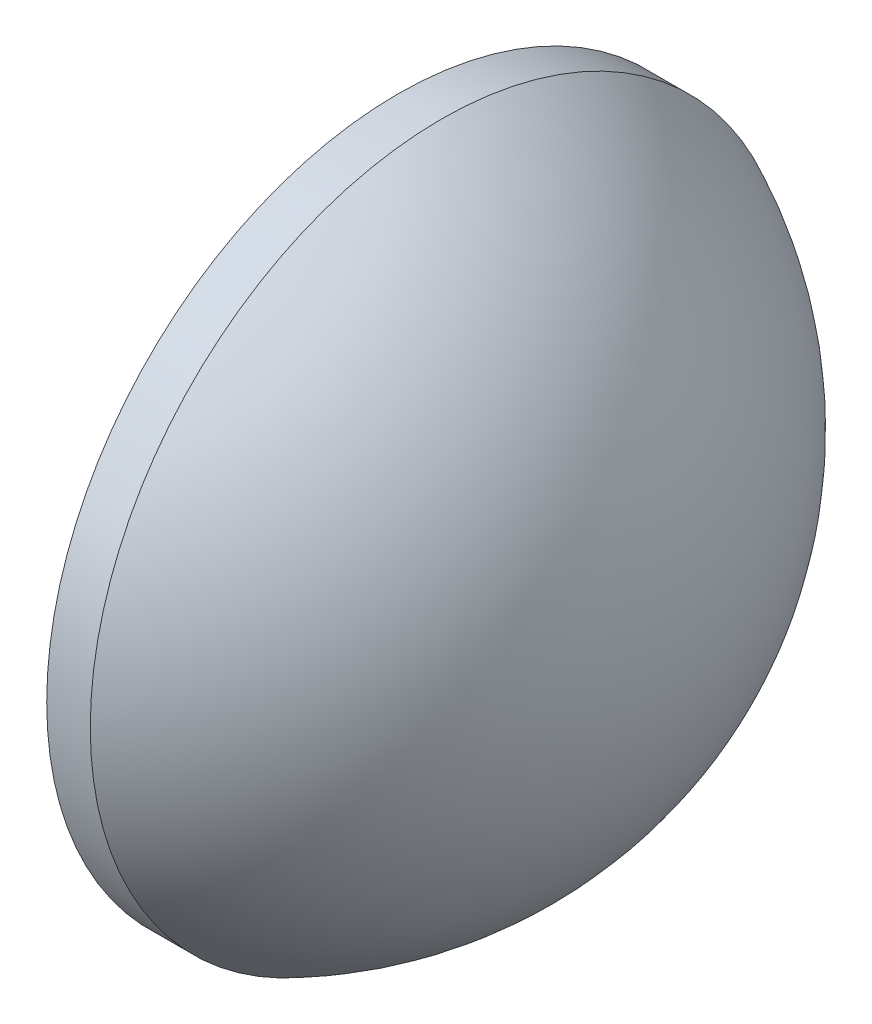
ISO-10303-21;
HEADER;
FILE_DESCRIPTION(('STEP AP214'),'2;1');
FILE_NAME('part.step','',(''),(''),'','','');
FILE_SCHEMA(('AUTOMOTIVE_DESIGN { 1 0 10303 214 1 1 1 1 }'));
ENDSEC;
DATA;
#1=APPLICATION_CONTEXT('core data for automotive mechanical design processes');
#2=APPLICATION_PROTOCOL_DEFINITION('international standard','automotive_design',2000,#1);
#3=PRODUCT_CONTEXT('',#1,'mechanical');
#4=PRODUCT('Part','Part','',(#3));
#5=PRODUCT_RELATED_PRODUCT_CATEGORY('part','',(#4));
#6=PRODUCT_DEFINITION_FORMATION('','',#4);
#7=PRODUCT_DEFINITION_CONTEXT('part definition',#1,'design');
#8=PRODUCT_DEFINITION('design','',#6,#7);
#9=PRODUCT_DEFINITION_SHAPE('','',#8);
#10=(LENGTH_UNIT() NAMED_UNIT(*) SI_UNIT(.MILLI.,.METRE.));
#11=(NAMED_UNIT(*) PLANE_ANGLE_UNIT() SI_UNIT($,.RADIAN.));
#12=(NAMED_UNIT(*) SI_UNIT($,.STERADIAN.) SOLID_ANGLE_UNIT());
#13=UNCERTAINTY_MEASURE_WITH_UNIT(LENGTH_MEASURE(1.E-05),#10,'distance_accuracy_value','');
#14=(GEOMETRIC_REPRESENTATION_CONTEXT(3) GLOBAL_UNCERTAINTY_ASSIGNED_CONTEXT((#13)) GLOBAL_UNIT_ASSIGNED_CONTEXT((#10,
#11,#12)) REPRESENTATION_CONTEXT('',''));
#15=CARTESIAN_POINT('',(0.,0.,0.));
#16=DIRECTION('',(0.,0.,1.));
#17=DIRECTION('',(1.,0.,0.));
#18=AXIS2_PLACEMENT_3D('',#15,#16,#17);
#19=CARTESIAN_POINT('',(484.064829982375,171.715697297245,0.));
#20=DIRECTION('',(-1.,0.,0.));
#21=DIRECTION('',(0.,-1.,0.));
#22=AXIS2_PLACEMENT_3D('',#19,#20,#21);
#23=SPHERICAL_SURFACE('',#22,13.8020440251572);
#24=CARTESIAN_POINT('',(489.916874007532,171.715697297245,0.));
#25=DIRECTION('',(-1.,0.,0.));
#26=DIRECTION('',(0.,0.,1.));
#27=AXIS2_PLACEMENT_3D('',#24,#25,#26);
#28=CIRCLE('',#27,12.5);
#29=CARTESIAN_POINT('',(489.916874007532,171.715697297245,12.5));
#30=VERTEX_POINT('',#29);
#31=EDGE_CURVE('E10',#30,#30,#28,.T.);
#32=ORIENTED_EDGE('',*,*,#31,.F.);
#33=EDGE_LOOP('',(#32));
#34=FACE_BOUND('',#33,.T.);
#35=ADVANCED_FACE('F33',(#34),#23,.T.);
#36=CARTESIAN_POINT('',(486.854842765642,171.715697297245,0.));
#37=DIRECTION('',(-1.,0.,0.));
#38=DIRECTION('',(0.,0.,1.));
#39=AXIS2_PLACEMENT_3D('',#36,#37,#38);
#40=CYLINDRICAL_SURFACE('',#39,12.5);
#41=CARTESIAN_POINT('',(488.366874007532,171.715697297245,0.));
#42=DIRECTION('',(-1.,0.,0.));
#43=DIRECTION('',(0.,0.,1.));
#44=AXIS2_PLACEMENT_3D('',#41,#42,#43);
#45=CIRCLE('',#44,12.5);
#46=CARTESIAN_POINT('',(488.366874007532,171.715697297245,12.5));
#47=VERTEX_POINT('',#46);
#48=EDGE_CURVE('E39',#47,#47,#45,.T.);
#49=ORIENTED_EDGE('',*,*,#48,.F.);
#50=EDGE_LOOP('',(#49));
#51=FACE_BOUND('',#50,.T.);
#52=ORIENTED_EDGE('',*,*,#31,.T.);
#53=EDGE_LOOP('',(#52));
#54=FACE_BOUND('',#53,.T.);
#55=ADVANCED_FACE('F47',(#51,#54),#40,.T.);
#56=CARTESIAN_POINT('',(488.366874007532,171.715697297245,0.));
#57=DIRECTION('',(1.,0.,0.));
#58=DIRECTION('',(0.,0.,-1.));
#59=AXIS2_PLACEMENT_3D('',#56,#57,#58);
#60=PLANE('',#59);
#61=ORIENTED_EDGE('',*,*,#48,.T.);
#62=EDGE_LOOP('',(#61));
#63=FACE_BOUND('',#62,.T.);
#64=ADVANCED_FACE('F45',(#63),#60,.F.);
#65=CLOSED_SHELL('',(#35,#55,#64));
#66=MANIFOLD_SOLID_BREP('B2',#65);
#67=ADVANCED_BREP_SHAPE_REPRESENTATION('',(#18,#66),#14);
#68=SHAPE_DEFINITION_REPRESENTATION(#9,#67);
ENDSEC;
END-ISO-10303-21;
